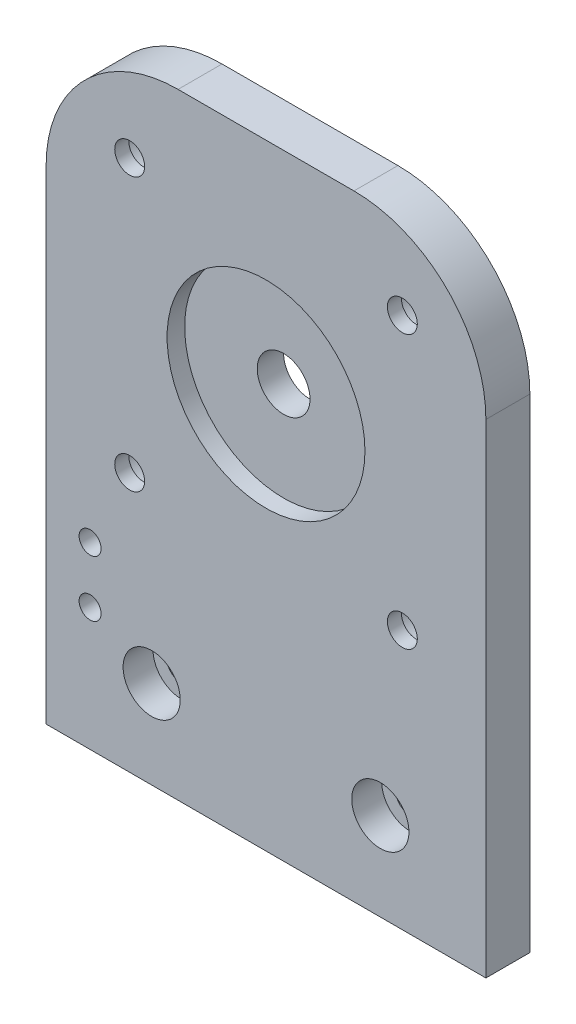
ISO-10303-21;
HEADER;
FILE_DESCRIPTION(('STEP AP214'),'2;1');
FILE_NAME('part.step','',(''),(''),'','','');
FILE_SCHEMA(('AUTOMOTIVE_DESIGN { 1 0 10303 214 1 1 1 1 }'));
ENDSEC;
DATA;
#1=APPLICATION_CONTEXT('core data for automotive mechanical design processes');
#2=APPLICATION_PROTOCOL_DEFINITION('international standard','automotive_design',2000,#1);
#3=PRODUCT_CONTEXT('',#1,'mechanical');
#4=PRODUCT('Part','Part','',(#3));
#5=PRODUCT_RELATED_PRODUCT_CATEGORY('part','',(#4));
#6=PRODUCT_DEFINITION_FORMATION('','',#4);
#7=PRODUCT_DEFINITION_CONTEXT('part definition',#1,'design');
#8=PRODUCT_DEFINITION('design','',#6,#7);
#9=PRODUCT_DEFINITION_SHAPE('','',#8);
#10=(LENGTH_UNIT() NAMED_UNIT(*) SI_UNIT(.MILLI.,.METRE.));
#11=(NAMED_UNIT(*) PLANE_ANGLE_UNIT() SI_UNIT($,.RADIAN.));
#12=(NAMED_UNIT(*) SI_UNIT($,.STERADIAN.) SOLID_ANGLE_UNIT());
#13=UNCERTAINTY_MEASURE_WITH_UNIT(LENGTH_MEASURE(1.E-05),#10,'distance_accuracy_value','');
#14=(GEOMETRIC_REPRESENTATION_CONTEXT(3) GLOBAL_UNCERTAINTY_ASSIGNED_CONTEXT((#13)) GLOBAL_UNIT_ASSIGNED_CONTEXT((#10,
#11,#12)) REPRESENTATION_CONTEXT('',''));
#15=CARTESIAN_POINT('',(0.,0.,0.));
#16=DIRECTION('',(0.,0.,1.));
#17=DIRECTION('',(1.,0.,0.));
#18=AXIS2_PLACEMENT_3D('',#15,#16,#17);
#19=CARTESIAN_POINT('',(25.,45.,5.));
#20=DIRECTION('',(0.,0.,-1.));
#21=DIRECTION('',(-1.,0.,0.));
#22=AXIS2_PLACEMENT_3D('',#19,#20,#21);
#23=CYLINDRICAL_SURFACE('',#22,3.);
#24=CARTESIAN_POINT('',(25.,45.,0.));
#25=DIRECTION('',(0.,0.,1.));
#26=DIRECTION('',(1.,0.,0.));
#27=AXIS2_PLACEMENT_3D('',#24,#25,#26);
#28=CIRCLE('',#27,3.);
#29=CARTESIAN_POINT('',(28.,45.,0.));
#30=VERTEX_POINT('',#29);
#31=EDGE_CURVE('E138',#30,#30,#28,.T.);
#32=ORIENTED_EDGE('',*,*,#31,.F.);
#33=EDGE_LOOP('',(#32));
#34=FACE_BOUND('',#33,.T.);
#35=CARTESIAN_POINT('',(25.,45.,3.));
#36=DIRECTION('',(0.,0.,1.));
#37=DIRECTION('',(1.,0.,0.));
#38=AXIS2_PLACEMENT_3D('',#35,#36,#37);
#39=CIRCLE('',#38,3.);
#40=CARTESIAN_POINT('',(28.,45.,3.));
#41=VERTEX_POINT('',#40);
#42=EDGE_CURVE('E46',#41,#41,#39,.T.);
#43=ORIENTED_EDGE('',*,*,#42,.T.);
#44=EDGE_LOOP('',(#43));
#45=FACE_BOUND('',#44,.T.);
#46=ADVANCED_FACE('F42',(#34,#45),#23,.F.);
#47=CARTESIAN_POINT('',(15.,55.,5.));
#48=DIRECTION('',(0.,0.,-1.));
#49=DIRECTION('',(-1.,0.,0.));
#50=AXIS2_PLACEMENT_3D('',#47,#48,#49);
#51=PLANE('',#50);
#52=CARTESIAN_POINT('',(5.,20.4,5.));
#53=DIRECTION('',(0.,0.,-1.));
#54=DIRECTION('',(-1.,0.,0.));
#55=AXIS2_PLACEMENT_3D('',#52,#53,#54);
#56=CIRCLE('',#55,1.25);
#57=CARTESIAN_POINT('',(3.75,20.4,5.));
#58=VERTEX_POINT('',#57);
#59=EDGE_CURVE('E364',#58,#58,#56,.T.);
#60=ORIENTED_EDGE('',*,*,#59,.T.);
#61=EDGE_LOOP('',(#60));
#62=FACE_BOUND('',#61,.T.);
#63=CARTESIAN_POINT('',(5.,14.,5.));
#64=DIRECTION('',(0.,0.,-1.));
#65=DIRECTION('',(-1.,0.,0.));
#66=AXIS2_PLACEMENT_3D('',#63,#64,#65);
#67=CIRCLE('',#66,1.25);
#68=CARTESIAN_POINT('',(3.75,14.,5.));
#69=VERTEX_POINT('',#68);
#70=EDGE_CURVE('E372',#69,#69,#67,.T.);
#71=ORIENTED_EDGE('',*,*,#70,.T.);
#72=EDGE_LOOP('',(#71));
#73=FACE_BOUND('',#72,.T.);
#74=CARTESIAN_POINT('',(38.,10.,5.));
#75=DIRECTION('',(0.,0.,1.));
#76=DIRECTION('',(1.,0.,0.));
#77=AXIS2_PLACEMENT_3D('',#74,#75,#76);
#78=CIRCLE('',#77,3.25);
#79=CARTESIAN_POINT('',(41.25,10.,5.));
#80=VERTEX_POINT('',#79);
#81=EDGE_CURVE('E376',#80,#80,#78,.T.);
#82=ORIENTED_EDGE('',*,*,#81,.F.);
#83=EDGE_LOOP('',(#82));
#84=FACE_BOUND('',#83,.T.);
#85=CARTESIAN_POINT('',(12.,10.,5.));
#86=DIRECTION('',(0.,0.,1.));
#87=DIRECTION('',(1.,0.,0.));
#88=AXIS2_PLACEMENT_3D('',#85,#86,#87);
#89=CIRCLE('',#88,3.25);
#90=CARTESIAN_POINT('',(15.25,10.,5.));
#91=VERTEX_POINT('',#90);
#92=EDGE_CURVE('E390',#91,#91,#89,.T.);
#93=ORIENTED_EDGE('',*,*,#92,.F.);
#94=EDGE_LOOP('',(#93));
#95=FACE_BOUND('',#94,.T.);
#96=CARTESIAN_POINT('',(9.5,29.5,5.));
#97=DIRECTION('',(0.,0.,-1.));
#98=DIRECTION('',(-1.,0.,0.));
#99=AXIS2_PLACEMENT_3D('',#96,#97,#98);
#100=CIRCLE('',#99,1.7);
#101=CARTESIAN_POINT('',(7.8,29.5,5.));
#102=VERTEX_POINT('',#101);
#103=EDGE_CURVE('E414',#102,#102,#100,.T.);
#104=ORIENTED_EDGE('',*,*,#103,.T.);
#105=EDGE_LOOP('',(#104));
#106=FACE_BOUND('',#105,.T.);
#107=CARTESIAN_POINT('',(9.5,60.5,5.));
#108=DIRECTION('',(0.,0.,-1.));
#109=DIRECTION('',(-1.,0.,0.));
#110=AXIS2_PLACEMENT_3D('',#107,#108,#109);
#111=CIRCLE('',#110,1.7);
#112=CARTESIAN_POINT('',(7.8,60.5,5.));
#113=VERTEX_POINT('',#112);
#114=EDGE_CURVE('E428',#113,#113,#111,.T.);
#115=ORIENTED_EDGE('',*,*,#114,.T.);
#116=EDGE_LOOP('',(#115));
#117=FACE_BOUND('',#116,.T.);
#118=CARTESIAN_POINT('',(40.5,60.5,5.));
#119=DIRECTION('',(0.,0.,-1.));
#120=DIRECTION('',(-1.,0.,0.));
#121=AXIS2_PLACEMENT_3D('',#118,#119,#120);
#122=CIRCLE('',#121,1.7);
#123=CARTESIAN_POINT('',(38.8,60.5,5.));
#124=VERTEX_POINT('',#123);
#125=EDGE_CURVE('E233',#124,#124,#122,.T.);
#126=ORIENTED_EDGE('',*,*,#125,.T.);
#127=EDGE_LOOP('',(#126));
#128=FACE_BOUND('',#127,.T.);
#129=CARTESIAN_POINT('',(40.5,29.5,5.));
#130=DIRECTION('',(0.,0.,-1.));
#131=DIRECTION('',(-1.,0.,0.));
#132=AXIS2_PLACEMENT_3D('',#129,#130,#131);
#133=CIRCLE('',#132,1.7);
#134=CARTESIAN_POINT('',(38.8,29.5,5.));
#135=VERTEX_POINT('',#134);
#136=EDGE_CURVE('E248',#135,#135,#133,.T.);
#137=ORIENTED_EDGE('',*,*,#136,.T.);
#138=EDGE_LOOP('',(#137));
#139=FACE_BOUND('',#138,.T.);
#140=CARTESIAN_POINT('',(25.,45.,5.));
#141=DIRECTION('',(0.,0.,1.));
#142=DIRECTION('',(1.,0.,0.));
#143=AXIS2_PLACEMENT_3D('',#140,#141,#142);
#144=CIRCLE('',#143,11.25);
#145=CARTESIAN_POINT('',(36.25,45.,5.));
#146=VERTEX_POINT('',#145);
#147=EDGE_CURVE('E252',#146,#146,#144,.T.);
#148=ORIENTED_EDGE('',*,*,#147,.F.);
#149=EDGE_LOOP('',(#148));
#150=FACE_BOUND('',#149,.T.);
#151=DIRECTION('',(0.,-1.,0.));
#152=VECTOR('',#151,1.);
#153=CARTESIAN_POINT('',(0.,0.,5.));
#154=LINE('',#153,#152);
#155=CARTESIAN_POINT('',(0.,55.,5.));
#156=VERTEX_POINT('',#155);
#157=CARTESIAN_POINT('',(0.,0.,5.));
#158=VERTEX_POINT('',#157);
#159=EDGE_CURVE('E150',#156,#158,#154,.T.);
#160=ORIENTED_EDGE('',*,*,#159,.T.);
#161=DIRECTION('',(1.,0.,0.));
#162=VECTOR('',#161,1.);
#163=CARTESIAN_POINT('',(0.,0.,5.));
#164=LINE('',#163,#162);
#165=CARTESIAN_POINT('',(50.,0.,5.));
#166=VERTEX_POINT('',#165);
#167=EDGE_CURVE('E98',#158,#166,#164,.T.);
#168=ORIENTED_EDGE('',*,*,#167,.T.);
#169=DIRECTION('',(0.,1.,0.));
#170=VECTOR('',#169,1.);
#171=CARTESIAN_POINT('',(50.,0.,5.));
#172=LINE('',#171,#170);
#173=CARTESIAN_POINT('',(50.,55.,5.));
#174=VERTEX_POINT('',#173);
#175=EDGE_CURVE('E111',#166,#174,#172,.T.);
#176=ORIENTED_EDGE('',*,*,#175,.T.);
#177=CARTESIAN_POINT('',(35.,55.,5.));
#178=DIRECTION('',(0.,0.,1.));
#179=DIRECTION('',(-1.,0.,0.));
#180=AXIS2_PLACEMENT_3D('',#177,#178,#179);
#181=CIRCLE('',#180,15.);
#182=CARTESIAN_POINT('',(35.,70.,5.));
#183=VERTEX_POINT('',#182);
#184=EDGE_CURVE('E105',#174,#183,#181,.T.);
#185=ORIENTED_EDGE('',*,*,#184,.T.);
#186=DIRECTION('',(-1.,0.,0.));
#187=VECTOR('',#186,1.);
#188=CARTESIAN_POINT('',(15.,70.,5.));
#189=LINE('',#188,#187);
#190=CARTESIAN_POINT('',(15.,70.,5.));
#191=VERTEX_POINT('',#190);
#192=EDGE_CURVE('E109',#183,#191,#189,.T.);
#193=ORIENTED_EDGE('',*,*,#192,.T.);
#194=CARTESIAN_POINT('',(15.,55.,5.));
#195=DIRECTION('',(0.,0.,1.));
#196=DIRECTION('',(-1.,0.,0.));
#197=AXIS2_PLACEMENT_3D('',#194,#195,#196);
#198=CIRCLE('',#197,15.);
#199=EDGE_CURVE('E61',#191,#156,#198,.T.);
#200=ORIENTED_EDGE('',*,*,#199,.T.);
#201=EDGE_LOOP('',(#160,#168,#176,#185,#193,#200));
#202=FACE_BOUND('',#201,.T.);
#203=ADVANCED_FACE('F107',(#62,#73,#84,#95,#106,#117,#128,#139,#150,#202),#51,.F.);
#204=CARTESIAN_POINT('',(15.,55.,0.));
#205=DIRECTION('',(0.,0.,-1.));
#206=DIRECTION('',(-1.,0.,0.));
#207=AXIS2_PLACEMENT_3D('',#204,#205,#206);
#208=PLANE('',#207);
#209=CARTESIAN_POINT('',(5.,20.4,0.));
#210=DIRECTION('',(0.,0.,-1.));
#211=DIRECTION('',(-1.,0.,0.));
#212=AXIS2_PLACEMENT_3D('',#209,#210,#211);
#213=CIRCLE('',#212,1.25);
#214=CARTESIAN_POINT('',(3.75,20.4,0.));
#215=VERTEX_POINT('',#214);
#216=EDGE_CURVE('E202',#215,#215,#213,.T.);
#217=ORIENTED_EDGE('',*,*,#216,.F.);
#218=EDGE_LOOP('',(#217));
#219=FACE_BOUND('',#218,.T.);
#220=CARTESIAN_POINT('',(5.,14.,0.));
#221=DIRECTION('',(0.,0.,-1.));
#222=DIRECTION('',(-1.,0.,0.));
#223=AXIS2_PLACEMENT_3D('',#220,#221,#222);
#224=CIRCLE('',#223,1.25);
#225=CARTESIAN_POINT('',(3.75,14.,0.));
#226=VERTEX_POINT('',#225);
#227=EDGE_CURVE('E206',#226,#226,#224,.T.);
#228=ORIENTED_EDGE('',*,*,#227,.F.);
#229=EDGE_LOOP('',(#228));
#230=FACE_BOUND('',#229,.T.);
#231=CARTESIAN_POINT('',(38.,10.,0.));
#232=DIRECTION('',(0.,0.,1.));
#233=DIRECTION('',(1.,0.,0.));
#234=AXIS2_PLACEMENT_3D('',#231,#232,#233);
#235=CIRCLE('',#234,1.7);
#236=CARTESIAN_POINT('',(39.7,10.,0.));
#237=VERTEX_POINT('',#236);
#238=EDGE_CURVE('E210',#237,#237,#235,.T.);
#239=ORIENTED_EDGE('',*,*,#238,.T.);
#240=EDGE_LOOP('',(#239));
#241=FACE_BOUND('',#240,.T.);
#242=CARTESIAN_POINT('',(12.,10.,0.));
#243=DIRECTION('',(0.,0.,1.));
#244=DIRECTION('',(1.,0.,0.));
#245=AXIS2_PLACEMENT_3D('',#242,#243,#244);
#246=CIRCLE('',#245,1.7);
#247=CARTESIAN_POINT('',(13.7,10.,0.));
#248=VERTEX_POINT('',#247);
#249=EDGE_CURVE('E214',#248,#248,#246,.T.);
#250=ORIENTED_EDGE('',*,*,#249,.T.);
#251=EDGE_LOOP('',(#250));
#252=FACE_BOUND('',#251,.T.);
#253=CARTESIAN_POINT('',(9.5,29.5,0.));
#254=DIRECTION('',(0.,0.,-1.));
#255=DIRECTION('',(-1.,0.,0.));
#256=AXIS2_PLACEMENT_3D('',#253,#254,#255);
#257=CIRCLE('',#256,3.25);
#258=CARTESIAN_POINT('',(6.25,29.5,0.));
#259=VERTEX_POINT('',#258);
#260=EDGE_CURVE('E218',#259,#259,#257,.T.);
#261=ORIENTED_EDGE('',*,*,#260,.F.);
#262=EDGE_LOOP('',(#261));
#263=FACE_BOUND('',#262,.T.);
#264=CARTESIAN_POINT('',(9.5,60.5,0.));
#265=DIRECTION('',(0.,0.,-1.));
#266=DIRECTION('',(-1.,0.,0.));
#267=AXIS2_PLACEMENT_3D('',#264,#265,#266);
#268=CIRCLE('',#267,3.25);
#269=CARTESIAN_POINT('',(6.25000000000001,60.5,0.));
#270=VERTEX_POINT('',#269);
#271=EDGE_CURVE('E222',#270,#270,#268,.T.);
#272=ORIENTED_EDGE('',*,*,#271,.F.);
#273=EDGE_LOOP('',(#272));
#274=FACE_BOUND('',#273,.T.);
#275=CARTESIAN_POINT('',(40.5,60.5,0.));
#276=DIRECTION('',(0.,0.,-1.));
#277=DIRECTION('',(-1.,0.,0.));
#278=AXIS2_PLACEMENT_3D('',#275,#276,#277);
#279=CIRCLE('',#278,3.25);
#280=CARTESIAN_POINT('',(37.25,60.5,0.));
#281=VERTEX_POINT('',#280);
#282=EDGE_CURVE('E226',#281,#281,#279,.T.);
#283=ORIENTED_EDGE('',*,*,#282,.F.);
#284=EDGE_LOOP('',(#283));
#285=FACE_BOUND('',#284,.T.);
#286=CARTESIAN_POINT('',(40.5,29.5,0.));
#287=DIRECTION('',(0.,0.,-1.));
#288=DIRECTION('',(-1.,0.,0.));
#289=AXIS2_PLACEMENT_3D('',#286,#287,#288);
#290=CIRCLE('',#289,3.25);
#291=CARTESIAN_POINT('',(37.25,29.5,0.));
#292=VERTEX_POINT('',#291);
#293=EDGE_CURVE('E229',#292,#292,#290,.T.);
#294=ORIENTED_EDGE('',*,*,#293,.F.);
#295=EDGE_LOOP('',(#294));
#296=FACE_BOUND('',#295,.T.);
#297=DIRECTION('',(0.,-1.,0.));
#298=VECTOR('',#297,1.);
#299=CARTESIAN_POINT('',(0.,0.,0.));
#300=LINE('',#299,#298);
#301=CARTESIAN_POINT('',(0.,55.,0.));
#302=VERTEX_POINT('',#301);
#303=CARTESIAN_POINT('',(0.,0.,0.));
#304=VERTEX_POINT('',#303);
#305=EDGE_CURVE('E133',#302,#304,#300,.T.);
#306=ORIENTED_EDGE('',*,*,#305,.F.);
#307=CARTESIAN_POINT('',(15.,55.,0.));
#308=DIRECTION('',(0.,0.,1.));
#309=DIRECTION('',(-1.,0.,0.));
#310=AXIS2_PLACEMENT_3D('',#307,#308,#309);
#311=CIRCLE('',#310,15.);
#312=CARTESIAN_POINT('',(15.,70.,0.));
#313=VERTEX_POINT('',#312);
#314=EDGE_CURVE('E90',#313,#302,#311,.T.);
#315=ORIENTED_EDGE('',*,*,#314,.F.);
#316=DIRECTION('',(-1.,0.,0.));
#317=VECTOR('',#316,1.);
#318=CARTESIAN_POINT('',(15.,70.,0.));
#319=LINE('',#318,#317);
#320=CARTESIAN_POINT('',(35.,70.,0.));
#321=VERTEX_POINT('',#320);
#322=EDGE_CURVE('E84',#321,#313,#319,.T.);
#323=ORIENTED_EDGE('',*,*,#322,.F.);
#324=CARTESIAN_POINT('',(35.,55.,0.));
#325=DIRECTION('',(0.,0.,1.));
#326=DIRECTION('',(-1.,0.,0.));
#327=AXIS2_PLACEMENT_3D('',#324,#325,#326);
#328=CIRCLE('',#327,15.);
#329=CARTESIAN_POINT('',(50.,55.,0.));
#330=VERTEX_POINT('',#329);
#331=EDGE_CURVE('E120',#330,#321,#328,.T.);
#332=ORIENTED_EDGE('',*,*,#331,.F.);
#333=DIRECTION('',(0.,1.,0.));
#334=VECTOR('',#333,1.);
#335=CARTESIAN_POINT('',(50.,0.,0.));
#336=LINE('',#335,#334);
#337=CARTESIAN_POINT('',(50.,0.,0.));
#338=VERTEX_POINT('',#337);
#339=EDGE_CURVE('E141',#338,#330,#336,.T.);
#340=ORIENTED_EDGE('',*,*,#339,.F.);
#341=DIRECTION('',(1.,0.,0.));
#342=VECTOR('',#341,1.);
#343=CARTESIAN_POINT('',(0.,0.,0.));
#344=LINE('',#343,#342);
#345=EDGE_CURVE('E137',#304,#338,#344,.T.);
#346=ORIENTED_EDGE('',*,*,#345,.F.);
#347=EDGE_LOOP('',(#306,#315,#323,#332,#340,#346));
#348=FACE_BOUND('',#347,.T.);
#349=ORIENTED_EDGE('',*,*,#31,.T.);
#350=EDGE_LOOP('',(#349));
#351=FACE_BOUND('',#350,.T.);
#352=ADVANCED_FACE('F164',(#219,#230,#241,#252,#263,#274,#285,#296,#348,#351),#208,.T.);
#353=CARTESIAN_POINT('',(0.,0.,5.));
#354=DIRECTION('',(1.,0.,0.));
#355=DIRECTION('',(0.,0.,-1.));
#356=AXIS2_PLACEMENT_3D('',#353,#354,#355);
#357=PLANE('',#356);
#358=ORIENTED_EDGE('',*,*,#305,.T.);
#359=DIRECTION('',(0.,0.,-1.));
#360=VECTOR('',#359,1.);
#361=CARTESIAN_POINT('',(0.,0.,5.));
#362=LINE('',#361,#360);
#363=EDGE_CURVE('E11',#158,#304,#362,.T.);
#364=ORIENTED_EDGE('',*,*,#363,.F.);
#365=ORIENTED_EDGE('',*,*,#159,.F.);
#366=DIRECTION('',(0.,0.,-1.));
#367=VECTOR('',#366,1.);
#368=CARTESIAN_POINT('',(0.,55.,5.));
#369=LINE('',#368,#367);
#370=EDGE_CURVE('E129',#156,#302,#369,.T.);
#371=ORIENTED_EDGE('',*,*,#370,.T.);
#372=EDGE_LOOP('',(#358,#364,#365,#371));
#373=FACE_BOUND('',#372,.T.);
#374=ADVANCED_FACE('F44',(#373),#357,.F.);
#375=CARTESIAN_POINT('',(0.,0.,5.));
#376=DIRECTION('',(0.,1.,0.));
#377=DIRECTION('',(0.,0.,1.));
#378=AXIS2_PLACEMENT_3D('',#375,#376,#377);
#379=PLANE('',#378);
#380=ORIENTED_EDGE('',*,*,#345,.T.);
#381=DIRECTION('',(0.,0.,-1.));
#382=VECTOR('',#381,1.);
#383=CARTESIAN_POINT('',(50.,0.,5.));
#384=LINE('',#383,#382);
#385=EDGE_CURVE('E53',#166,#338,#384,.T.);
#386=ORIENTED_EDGE('',*,*,#385,.F.);
#387=ORIENTED_EDGE('',*,*,#167,.F.);
#388=ORIENTED_EDGE('',*,*,#363,.T.);
#389=EDGE_LOOP('',(#380,#386,#387,#388));
#390=FACE_BOUND('',#389,.T.);
#391=ADVANCED_FACE('F198',(#390),#379,.F.);
#392=CARTESIAN_POINT('',(50.,0.,5.));
#393=DIRECTION('',(-1.,0.,0.));
#394=DIRECTION('',(0.,0.,1.));
#395=AXIS2_PLACEMENT_3D('',#392,#393,#394);
#396=PLANE('',#395);
#397=ORIENTED_EDGE('',*,*,#339,.T.);
#398=DIRECTION('',(0.,0.,-1.));
#399=VECTOR('',#398,1.);
#400=CARTESIAN_POINT('',(50.,55.,5.));
#401=LINE('',#400,#399);
#402=EDGE_CURVE('E122',#174,#330,#401,.T.);
#403=ORIENTED_EDGE('',*,*,#402,.F.);
#404=ORIENTED_EDGE('',*,*,#175,.F.);
#405=ORIENTED_EDGE('',*,*,#385,.T.);
#406=EDGE_LOOP('',(#397,#403,#404,#405));
#407=FACE_BOUND('',#406,.T.);
#408=ADVANCED_FACE('F161',(#407),#396,.F.);
#409=CARTESIAN_POINT('',(35.,55.,5.));
#410=DIRECTION('',(0.,0.,-1.));
#411=DIRECTION('',(-1.,0.,0.));
#412=AXIS2_PLACEMENT_3D('',#409,#410,#411);
#413=CYLINDRICAL_SURFACE('',#412,15.);
#414=ORIENTED_EDGE('',*,*,#331,.T.);
#415=DIRECTION('',(0.,0.,-1.));
#416=VECTOR('',#415,1.);
#417=CARTESIAN_POINT('',(35.,70.,5.));
#418=LINE('',#417,#416);
#419=EDGE_CURVE('E117',#183,#321,#418,.T.);
#420=ORIENTED_EDGE('',*,*,#419,.F.);
#421=ORIENTED_EDGE('',*,*,#184,.F.);
#422=ORIENTED_EDGE('',*,*,#402,.T.);
#423=EDGE_LOOP('',(#414,#420,#421,#422));
#424=FACE_BOUND('',#423,.T.);
#425=ADVANCED_FACE('F118',(#424),#413,.T.);
#426=CARTESIAN_POINT('',(15.,70.,5.));
#427=DIRECTION('',(0.,-1.,0.));
#428=DIRECTION('',(0.,0.,-1.));
#429=AXIS2_PLACEMENT_3D('',#426,#427,#428);
#430=PLANE('',#429);
#431=ORIENTED_EDGE('',*,*,#322,.T.);
#432=DIRECTION('',(0.,0.,-1.));
#433=VECTOR('',#432,1.);
#434=CARTESIAN_POINT('',(15.,70.,5.));
#435=LINE('',#434,#433);
#436=EDGE_CURVE('E123',#191,#313,#435,.T.);
#437=ORIENTED_EDGE('',*,*,#436,.F.);
#438=ORIENTED_EDGE('',*,*,#192,.F.);
#439=ORIENTED_EDGE('',*,*,#419,.T.);
#440=EDGE_LOOP('',(#431,#437,#438,#439));
#441=FACE_BOUND('',#440,.T.);
#442=ADVANCED_FACE('F125',(#441),#430,.F.);
#443=CARTESIAN_POINT('',(15.,55.,5.));
#444=DIRECTION('',(0.,0.,-1.));
#445=DIRECTION('',(-1.,0.,0.));
#446=AXIS2_PLACEMENT_3D('',#443,#444,#445);
#447=CYLINDRICAL_SURFACE('',#446,15.);
#448=ORIENTED_EDGE('',*,*,#314,.T.);
#449=ORIENTED_EDGE('',*,*,#370,.F.);
#450=ORIENTED_EDGE('',*,*,#199,.F.);
#451=ORIENTED_EDGE('',*,*,#436,.T.);
#452=EDGE_LOOP('',(#448,#449,#450,#451));
#453=FACE_BOUND('',#452,.T.);
#454=ADVANCED_FACE('F169',(#453),#447,.T.);
#455=CARTESIAN_POINT('',(25.,45.,3.));
#456=DIRECTION('',(0.,0.,1.));
#457=DIRECTION('',(1.,0.,0.));
#458=AXIS2_PLACEMENT_3D('',#455,#456,#457);
#459=CYLINDRICAL_SURFACE('',#458,11.25);
#460=CARTESIAN_POINT('',(25.,45.,3.));
#461=DIRECTION('',(0.,0.,1.));
#462=DIRECTION('',(1.,0.,0.));
#463=AXIS2_PLACEMENT_3D('',#460,#461,#462);
#464=CIRCLE('',#463,11.25);
#465=CARTESIAN_POINT('',(36.25,45.,3.));
#466=VERTEX_POINT('',#465);
#467=EDGE_CURVE('E253',#466,#466,#464,.T.);
#468=ORIENTED_EDGE('',*,*,#467,.F.);
#469=EDGE_LOOP('',(#468));
#470=FACE_BOUND('',#469,.T.);
#471=ORIENTED_EDGE('',*,*,#147,.T.);
#472=EDGE_LOOP('',(#471));
#473=FACE_BOUND('',#472,.T.);
#474=ADVANCED_FACE('F171',(#470,#473),#459,.F.);
#475=CARTESIAN_POINT('',(25.,45.,3.));
#476=DIRECTION('',(0.,0.,1.));
#477=DIRECTION('',(1.,0.,0.));
#478=AXIS2_PLACEMENT_3D('',#475,#476,#477);
#479=PLANE('',#478);
#480=ORIENTED_EDGE('',*,*,#42,.F.);
#481=EDGE_LOOP('',(#480));
#482=FACE_BOUND('',#481,.T.);
#483=ORIENTED_EDGE('',*,*,#467,.T.);
#484=EDGE_LOOP('',(#483));
#485=FACE_BOUND('',#484,.T.);
#486=ADVANCED_FACE('F177',(#482,#485),#479,.T.);
#487=CARTESIAN_POINT('',(40.5,29.5,0.));
#488=DIRECTION('',(0.,0.,-1.));
#489=DIRECTION('',(-1.,0.,0.));
#490=AXIS2_PLACEMENT_3D('',#487,#488,#489);
#491=CYLINDRICAL_SURFACE('',#490,1.70000000000001);
#492=ORIENTED_EDGE('',*,*,#136,.F.);
#493=EDGE_LOOP('',(#492));
#494=FACE_BOUND('',#493,.T.);
#495=CARTESIAN_POINT('',(40.5,29.5,3.4));
#496=DIRECTION('',(0.,0.,-1.));
#497=DIRECTION('',(-1.,0.,0.));
#498=AXIS2_PLACEMENT_3D('',#495,#496,#497);
#499=CIRCLE('',#498,1.70000000000001);
#500=CARTESIAN_POINT('',(38.8,29.5,3.4));
#501=VERTEX_POINT('',#500);
#502=EDGE_CURVE('E238',#501,#501,#499,.T.);
#503=ORIENTED_EDGE('',*,*,#502,.T.);
#504=EDGE_LOOP('',(#503));
#505=FACE_BOUND('',#504,.T.);
#506=ADVANCED_FACE('F273',(#494,#505),#491,.F.);
#507=CARTESIAN_POINT('',(42.2,29.5,3.4));
#508=DIRECTION('',(0.,0.,1.));
#509=DIRECTION('',(1.,0.,0.));
#510=AXIS2_PLACEMENT_3D('',#507,#508,#509);
#511=PLANE('',#510);
#512=ORIENTED_EDGE('',*,*,#502,.F.);
#513=EDGE_LOOP('',(#512));
#514=FACE_BOUND('',#513,.T.);
#515=CARTESIAN_POINT('',(40.5,29.5,3.4));
#516=DIRECTION('',(0.,0.,-1.));
#517=DIRECTION('',(-1.,0.,0.));
#518=AXIS2_PLACEMENT_3D('',#515,#516,#517);
#519=CIRCLE('',#518,3.25);
#520=CARTESIAN_POINT('',(37.25,29.5,3.4));
#521=VERTEX_POINT('',#520);
#522=EDGE_CURVE('E232',#521,#521,#519,.T.);
#523=ORIENTED_EDGE('',*,*,#522,.T.);
#524=EDGE_LOOP('',(#523));
#525=FACE_BOUND('',#524,.T.);
#526=ADVANCED_FACE('F281',(#514,#525),#511,.F.);
#527=CARTESIAN_POINT('',(40.5,29.5,0.));
#528=DIRECTION('',(0.,0.,-1.));
#529=DIRECTION('',(-1.,0.,0.));
#530=AXIS2_PLACEMENT_3D('',#527,#528,#529);
#531=CYLINDRICAL_SURFACE('',#530,3.25);
#532=ORIENTED_EDGE('',*,*,#522,.F.);
#533=EDGE_LOOP('',(#532));
#534=FACE_BOUND('',#533,.T.);
#535=ORIENTED_EDGE('',*,*,#293,.T.);
#536=EDGE_LOOP('',(#535));
#537=FACE_BOUND('',#536,.T.);
#538=ADVANCED_FACE('F287',(#534,#537),#531,.F.);
#539=CARTESIAN_POINT('',(40.5,60.5,0.));
#540=DIRECTION('',(0.,0.,-1.));
#541=DIRECTION('',(-1.,0.,0.));
#542=AXIS2_PLACEMENT_3D('',#539,#540,#541);
#543=CYLINDRICAL_SURFACE('',#542,1.70000000000001);
#544=ORIENTED_EDGE('',*,*,#125,.F.);
#545=EDGE_LOOP('',(#544));
#546=FACE_BOUND('',#545,.T.);
#547=CARTESIAN_POINT('',(40.5,60.5,3.4));
#548=DIRECTION('',(0.,0.,-1.));
#549=DIRECTION('',(-1.,0.,0.));
#550=AXIS2_PLACEMENT_3D('',#547,#548,#549);
#551=CIRCLE('',#550,1.70000000000001);
#552=CARTESIAN_POINT('',(38.8,60.5,3.4));
#553=VERTEX_POINT('',#552);
#554=EDGE_CURVE('E241',#553,#553,#551,.T.);
#555=ORIENTED_EDGE('',*,*,#554,.T.);
#556=EDGE_LOOP('',(#555));
#557=FACE_BOUND('',#556,.T.);
#558=ADVANCED_FACE('F291',(#546,#557),#543,.F.);
#559=CARTESIAN_POINT('',(42.2,60.5,3.4));
#560=DIRECTION('',(0.,0.,1.));
#561=DIRECTION('',(1.,0.,0.));
#562=AXIS2_PLACEMENT_3D('',#559,#560,#561);
#563=PLANE('',#562);
#564=ORIENTED_EDGE('',*,*,#554,.F.);
#565=EDGE_LOOP('',(#564));
#566=FACE_BOUND('',#565,.T.);
#567=CARTESIAN_POINT('',(40.5,60.5,3.4));
#568=DIRECTION('',(0.,0.,-1.));
#569=DIRECTION('',(-1.,0.,0.));
#570=AXIS2_PLACEMENT_3D('',#567,#568,#569);
#571=CIRCLE('',#570,3.25);
#572=CARTESIAN_POINT('',(37.25,60.5,3.4));
#573=VERTEX_POINT('',#572);
#574=EDGE_CURVE('E434',#573,#573,#571,.T.);
#575=ORIENTED_EDGE('',*,*,#574,.T.);
#576=EDGE_LOOP('',(#575));
#577=FACE_BOUND('',#576,.T.);
#578=ADVANCED_FACE('F295',(#566,#577),#563,.F.);
#579=CARTESIAN_POINT('',(40.5,60.5,0.));
#580=DIRECTION('',(0.,0.,-1.));
#581=DIRECTION('',(-1.,0.,0.));
#582=AXIS2_PLACEMENT_3D('',#579,#580,#581);
#583=CYLINDRICAL_SURFACE('',#582,3.25);
#584=ORIENTED_EDGE('',*,*,#574,.F.);
#585=EDGE_LOOP('',(#584));
#586=FACE_BOUND('',#585,.T.);
#587=ORIENTED_EDGE('',*,*,#282,.T.);
#588=EDGE_LOOP('',(#587));
#589=FACE_BOUND('',#588,.T.);
#590=ADVANCED_FACE('F299',(#586,#589),#583,.F.);
#591=CARTESIAN_POINT('',(9.5,60.5,0.));
#592=DIRECTION('',(0.,0.,-1.));
#593=DIRECTION('',(-1.,0.,0.));
#594=AXIS2_PLACEMENT_3D('',#591,#592,#593);
#595=CYLINDRICAL_SURFACE('',#594,1.70000000000001);
#596=ORIENTED_EDGE('',*,*,#114,.F.);
#597=EDGE_LOOP('',(#596));
#598=FACE_BOUND('',#597,.T.);
#599=CARTESIAN_POINT('',(9.5,60.5,3.4));
#600=DIRECTION('',(0.,0.,-1.));
#601=DIRECTION('',(-1.,0.,0.));
#602=AXIS2_PLACEMENT_3D('',#599,#600,#601);
#603=CIRCLE('',#602,1.70000000000001);
#604=CARTESIAN_POINT('',(7.79999999999999,60.5,3.4));
#605=VERTEX_POINT('',#604);
#606=EDGE_CURVE('E424',#605,#605,#603,.T.);
#607=ORIENTED_EDGE('',*,*,#606,.T.);
#608=EDGE_LOOP('',(#607));
#609=FACE_BOUND('',#608,.T.);
#610=ADVANCED_FACE('F303',(#598,#609),#595,.F.);
#611=CARTESIAN_POINT('',(11.2,60.5,3.4));
#612=DIRECTION('',(0.,0.,1.));
#613=DIRECTION('',(1.,0.,0.));
#614=AXIS2_PLACEMENT_3D('',#611,#612,#613);
#615=PLANE('',#614);
#616=ORIENTED_EDGE('',*,*,#606,.F.);
#617=EDGE_LOOP('',(#616));
#618=FACE_BOUND('',#617,.T.);
#619=CARTESIAN_POINT('',(9.5,60.5,3.4));
#620=DIRECTION('',(0.,0.,-1.));
#621=DIRECTION('',(-1.,0.,0.));
#622=AXIS2_PLACEMENT_3D('',#619,#620,#621);
#623=CIRCLE('',#622,3.25);
#624=CARTESIAN_POINT('',(6.25000000000001,60.5,3.4));
#625=VERTEX_POINT('',#624);
#626=EDGE_CURVE('E420',#625,#625,#623,.T.);
#627=ORIENTED_EDGE('',*,*,#626,.T.);
#628=EDGE_LOOP('',(#627));
#629=FACE_BOUND('',#628,.T.);
#630=ADVANCED_FACE('F307',(#618,#629),#615,.F.);
#631=CARTESIAN_POINT('',(9.5,60.5,0.));
#632=DIRECTION('',(0.,0.,-1.));
#633=DIRECTION('',(-1.,0.,0.));
#634=AXIS2_PLACEMENT_3D('',#631,#632,#633);
#635=CYLINDRICAL_SURFACE('',#634,3.25);
#636=ORIENTED_EDGE('',*,*,#626,.F.);
#637=EDGE_LOOP('',(#636));
#638=FACE_BOUND('',#637,.T.);
#639=ORIENTED_EDGE('',*,*,#271,.T.);
#640=EDGE_LOOP('',(#639));
#641=FACE_BOUND('',#640,.T.);
#642=ADVANCED_FACE('F311',(#638,#641),#635,.F.);
#643=CARTESIAN_POINT('',(9.5,29.5,0.));
#644=DIRECTION('',(0.,0.,-1.));
#645=DIRECTION('',(-1.,0.,0.));
#646=AXIS2_PLACEMENT_3D('',#643,#644,#645);
#647=CYLINDRICAL_SURFACE('',#646,1.70000000000001);
#648=ORIENTED_EDGE('',*,*,#103,.F.);
#649=EDGE_LOOP('',(#648));
#650=FACE_BOUND('',#649,.T.);
#651=CARTESIAN_POINT('',(9.5,29.5,3.4));
#652=DIRECTION('',(0.,0.,-1.));
#653=DIRECTION('',(-1.,0.,0.));
#654=AXIS2_PLACEMENT_3D('',#651,#652,#653);
#655=CIRCLE('',#654,1.70000000000001);
#656=CARTESIAN_POINT('',(7.79999999999999,29.5,3.4));
#657=VERTEX_POINT('',#656);
#658=EDGE_CURVE('E410',#657,#657,#655,.T.);
#659=ORIENTED_EDGE('',*,*,#658,.T.);
#660=EDGE_LOOP('',(#659));
#661=FACE_BOUND('',#660,.T.);
#662=ADVANCED_FACE('F315',(#650,#661),#647,.F.);
#663=CARTESIAN_POINT('',(11.2,29.5,3.4));
#664=DIRECTION('',(0.,0.,1.));
#665=DIRECTION('',(1.,0.,0.));
#666=AXIS2_PLACEMENT_3D('',#663,#664,#665);
#667=PLANE('',#666);
#668=ORIENTED_EDGE('',*,*,#658,.F.);
#669=EDGE_LOOP('',(#668));
#670=FACE_BOUND('',#669,.T.);
#671=CARTESIAN_POINT('',(9.5,29.5,3.4));
#672=DIRECTION('',(0.,0.,-1.));
#673=DIRECTION('',(-1.,0.,0.));
#674=AXIS2_PLACEMENT_3D('',#671,#672,#673);
#675=CIRCLE('',#674,3.25);
#676=CARTESIAN_POINT('',(6.25,29.5,3.4));
#677=VERTEX_POINT('',#676);
#678=EDGE_CURVE('E406',#677,#677,#675,.T.);
#679=ORIENTED_EDGE('',*,*,#678,.T.);
#680=EDGE_LOOP('',(#679));
#681=FACE_BOUND('',#680,.T.);
#682=ADVANCED_FACE('F319',(#670,#681),#667,.F.);
#683=CARTESIAN_POINT('',(9.5,29.5,0.));
#684=DIRECTION('',(0.,0.,-1.));
#685=DIRECTION('',(-1.,0.,0.));
#686=AXIS2_PLACEMENT_3D('',#683,#684,#685);
#687=CYLINDRICAL_SURFACE('',#686,3.25);
#688=ORIENTED_EDGE('',*,*,#678,.F.);
#689=EDGE_LOOP('',(#688));
#690=FACE_BOUND('',#689,.T.);
#691=ORIENTED_EDGE('',*,*,#260,.T.);
#692=EDGE_LOOP('',(#691));
#693=FACE_BOUND('',#692,.T.);
#694=ADVANCED_FACE('F323',(#690,#693),#687,.F.);
#695=CARTESIAN_POINT('',(12.,10.,5.));
#696=DIRECTION('',(0.,0.,1.));
#697=DIRECTION('',(1.,0.,0.));
#698=AXIS2_PLACEMENT_3D('',#695,#696,#697);
#699=CYLINDRICAL_SURFACE('',#698,1.70000000000001);
#700=ORIENTED_EDGE('',*,*,#249,.F.);
#701=EDGE_LOOP('',(#700));
#702=FACE_BOUND('',#701,.T.);
#703=CARTESIAN_POINT('',(12.,10.,1.6));
#704=DIRECTION('',(0.,0.,1.));
#705=DIRECTION('',(1.,0.,0.));
#706=AXIS2_PLACEMENT_3D('',#703,#704,#705);
#707=CIRCLE('',#706,1.70000000000001);
#708=CARTESIAN_POINT('',(13.7,10.,1.6));
#709=VERTEX_POINT('',#708);
#710=EDGE_CURVE('E398',#709,#709,#707,.T.);
#711=ORIENTED_EDGE('',*,*,#710,.T.);
#712=EDGE_LOOP('',(#711));
#713=FACE_BOUND('',#712,.T.);
#714=ADVANCED_FACE('F327',(#702,#713),#699,.F.);
#715=CARTESIAN_POINT('',(13.7,10.,1.6));
#716=DIRECTION('',(0.,0.,-1.));
#717=DIRECTION('',(-1.,0.,0.));
#718=AXIS2_PLACEMENT_3D('',#715,#716,#717);
#719=PLANE('',#718);
#720=ORIENTED_EDGE('',*,*,#710,.F.);
#721=EDGE_LOOP('',(#720));
#722=FACE_BOUND('',#721,.T.);
#723=CARTESIAN_POINT('',(12.,10.,1.6));
#724=DIRECTION('',(0.,0.,1.));
#725=DIRECTION('',(1.,0.,0.));
#726=AXIS2_PLACEMENT_3D('',#723,#724,#725);
#727=CIRCLE('',#726,3.25);
#728=CARTESIAN_POINT('',(15.25,10.,1.6));
#729=VERTEX_POINT('',#728);
#730=EDGE_CURVE('E394',#729,#729,#727,.T.);
#731=ORIENTED_EDGE('',*,*,#730,.T.);
#732=EDGE_LOOP('',(#731));
#733=FACE_BOUND('',#732,.T.);
#734=ADVANCED_FACE('F331',(#722,#733),#719,.F.);
#735=CARTESIAN_POINT('',(12.,10.,5.));
#736=DIRECTION('',(0.,0.,1.));
#737=DIRECTION('',(1.,0.,0.));
#738=AXIS2_PLACEMENT_3D('',#735,#736,#737);
#739=CYLINDRICAL_SURFACE('',#738,3.25);
#740=ORIENTED_EDGE('',*,*,#730,.F.);
#741=EDGE_LOOP('',(#740));
#742=FACE_BOUND('',#741,.T.);
#743=ORIENTED_EDGE('',*,*,#92,.T.);
#744=EDGE_LOOP('',(#743));
#745=FACE_BOUND('',#744,.T.);
#746=ADVANCED_FACE('F335',(#742,#745),#739,.F.);
#747=CARTESIAN_POINT('',(38.,10.,5.));
#748=DIRECTION('',(0.,0.,1.));
#749=DIRECTION('',(1.,0.,0.));
#750=AXIS2_PLACEMENT_3D('',#747,#748,#749);
#751=CYLINDRICAL_SURFACE('',#750,1.70000000000001);
#752=ORIENTED_EDGE('',*,*,#238,.F.);
#753=EDGE_LOOP('',(#752));
#754=FACE_BOUND('',#753,.T.);
#755=CARTESIAN_POINT('',(38.,10.,1.6));
#756=DIRECTION('',(0.,0.,1.));
#757=DIRECTION('',(1.,0.,0.));
#758=AXIS2_PLACEMENT_3D('',#755,#756,#757);
#759=CIRCLE('',#758,1.70000000000001);
#760=CARTESIAN_POINT('',(39.7,10.,1.6));
#761=VERTEX_POINT('',#760);
#762=EDGE_CURVE('E384',#761,#761,#759,.T.);
#763=ORIENTED_EDGE('',*,*,#762,.T.);
#764=EDGE_LOOP('',(#763));
#765=FACE_BOUND('',#764,.T.);
#766=ADVANCED_FACE('F339',(#754,#765),#751,.F.);
#767=CARTESIAN_POINT('',(39.7,10.,1.6));
#768=DIRECTION('',(0.,0.,-1.));
#769=DIRECTION('',(-1.,0.,0.));
#770=AXIS2_PLACEMENT_3D('',#767,#768,#769);
#771=PLANE('',#770);
#772=ORIENTED_EDGE('',*,*,#762,.F.);
#773=EDGE_LOOP('',(#772));
#774=FACE_BOUND('',#773,.T.);
#775=CARTESIAN_POINT('',(38.,10.,1.6));
#776=DIRECTION('',(0.,0.,1.));
#777=DIRECTION('',(1.,0.,0.));
#778=AXIS2_PLACEMENT_3D('',#775,#776,#777);
#779=CIRCLE('',#778,3.25);
#780=CARTESIAN_POINT('',(41.25,10.,1.6));
#781=VERTEX_POINT('',#780);
#782=EDGE_CURVE('E380',#781,#781,#779,.T.);
#783=ORIENTED_EDGE('',*,*,#782,.T.);
#784=EDGE_LOOP('',(#783));
#785=FACE_BOUND('',#784,.T.);
#786=ADVANCED_FACE('F343',(#774,#785),#771,.F.);
#787=CARTESIAN_POINT('',(38.,10.,5.));
#788=DIRECTION('',(0.,0.,1.));
#789=DIRECTION('',(1.,0.,0.));
#790=AXIS2_PLACEMENT_3D('',#787,#788,#789);
#791=CYLINDRICAL_SURFACE('',#790,3.25);
#792=ORIENTED_EDGE('',*,*,#782,.F.);
#793=EDGE_LOOP('',(#792));
#794=FACE_BOUND('',#793,.T.);
#795=ORIENTED_EDGE('',*,*,#81,.T.);
#796=EDGE_LOOP('',(#795));
#797=FACE_BOUND('',#796,.T.);
#798=ADVANCED_FACE('F347',(#794,#797),#791,.F.);
#799=CARTESIAN_POINT('',(5.,14.,0.));
#800=DIRECTION('',(0.,0.,-1.));
#801=DIRECTION('',(-1.,0.,0.));
#802=AXIS2_PLACEMENT_3D('',#799,#800,#801);
#803=CYLINDRICAL_SURFACE('',#802,1.25);
#804=ORIENTED_EDGE('',*,*,#70,.F.);
#805=EDGE_LOOP('',(#804));
#806=FACE_BOUND('',#805,.T.);
#807=ORIENTED_EDGE('',*,*,#227,.T.);
#808=EDGE_LOOP('',(#807));
#809=FACE_BOUND('',#808,.T.);
#810=ADVANCED_FACE('F351',(#806,#809),#803,.F.);
#811=CARTESIAN_POINT('',(5.,20.4,0.));
#812=DIRECTION('',(0.,0.,-1.));
#813=DIRECTION('',(-1.,0.,0.));
#814=AXIS2_PLACEMENT_3D('',#811,#812,#813);
#815=CYLINDRICAL_SURFACE('',#814,1.25);
#816=ORIENTED_EDGE('',*,*,#59,.F.);
#817=EDGE_LOOP('',(#816));
#818=FACE_BOUND('',#817,.T.);
#819=ORIENTED_EDGE('',*,*,#216,.T.);
#820=EDGE_LOOP('',(#819));
#821=FACE_BOUND('',#820,.T.);
#822=ADVANCED_FACE('F355',(#818,#821),#815,.F.);
#823=CLOSED_SHELL('',(#46,#203,#352,#374,#391,#408,#425,#442,#454,#474,#486,#506,#526,#538,#558,
#578,#590,#610,#630,#642,#662,#682,#694,#714,#734,#746,#766,#786,#798,#810,#822));
#824=MANIFOLD_SOLID_BREP('B2',#823);
#825=ADVANCED_BREP_SHAPE_REPRESENTATION('',(#18,#824),#14);
#826=SHAPE_DEFINITION_REPRESENTATION(#9,#825);
ENDSEC;
END-ISO-10303-21;
